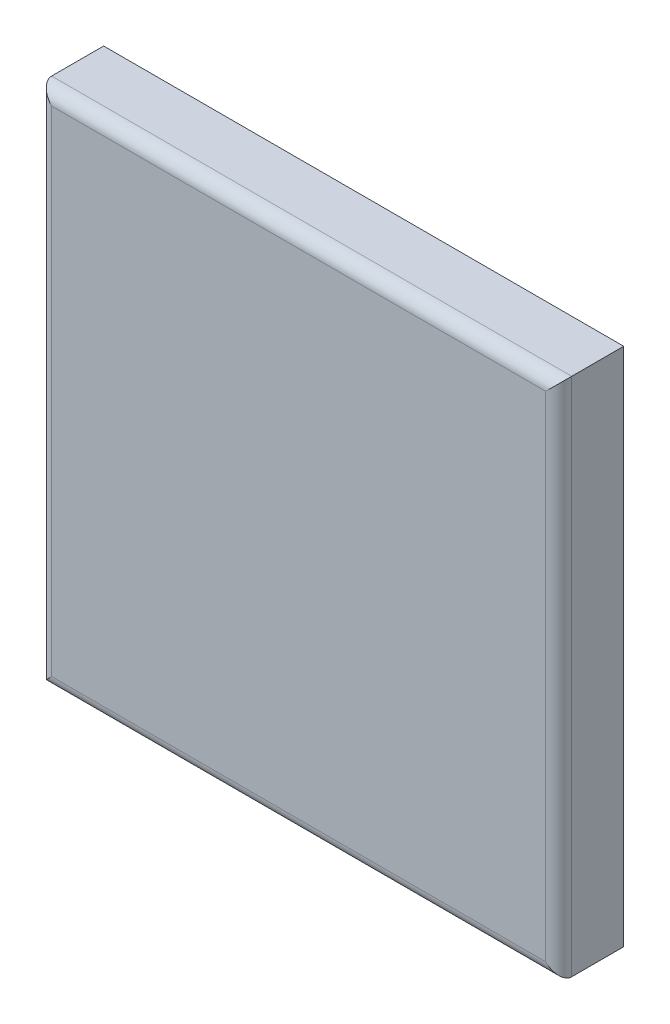
ISO-10303-21;
HEADER;
FILE_DESCRIPTION(('STEP AP214'),'2;1');
FILE_NAME('part.step','',(''),(''),'','','');
FILE_SCHEMA(('AUTOMOTIVE_DESIGN { 1 0 10303 214 1 1 1 1 }'));
ENDSEC;
DATA;
#1=APPLICATION_CONTEXT('core data for automotive mechanical design processes');
#2=APPLICATION_PROTOCOL_DEFINITION('international standard','automotive_design',2000,#1);
#3=PRODUCT_CONTEXT('',#1,'mechanical');
#4=PRODUCT('Part','Part','',(#3));
#5=PRODUCT_RELATED_PRODUCT_CATEGORY('part','',(#4));
#6=PRODUCT_DEFINITION_FORMATION('','',#4);
#7=PRODUCT_DEFINITION_CONTEXT('part definition',#1,'design');
#8=PRODUCT_DEFINITION('design','',#6,#7);
#9=PRODUCT_DEFINITION_SHAPE('','',#8);
#10=(LENGTH_UNIT() NAMED_UNIT(*) SI_UNIT(.MILLI.,.METRE.));
#11=(NAMED_UNIT(*) PLANE_ANGLE_UNIT() SI_UNIT($,.RADIAN.));
#12=(NAMED_UNIT(*) SI_UNIT($,.STERADIAN.) SOLID_ANGLE_UNIT());
#13=UNCERTAINTY_MEASURE_WITH_UNIT(LENGTH_MEASURE(1.E-05),#10,'distance_accuracy_value','');
#14=(GEOMETRIC_REPRESENTATION_CONTEXT(3) GLOBAL_UNCERTAINTY_ASSIGNED_CONTEXT((#13)) GLOBAL_UNIT_ASSIGNED_CONTEXT((#10,
#11,#12)) REPRESENTATION_CONTEXT('',''));
#15=CARTESIAN_POINT('',(0.,0.,0.));
#16=DIRECTION('',(0.,0.,1.));
#17=DIRECTION('',(1.,0.,0.));
#18=AXIS2_PLACEMENT_3D('',#15,#16,#17);
#19=CARTESIAN_POINT('',(0.5,-0.5,0.25));
#20=DIRECTION('',(-1.,0.,0.));
#21=DIRECTION('',(0.,0.,1.));
#22=AXIS2_PLACEMENT_3D('',#19,#20,#21);
#23=PLANE('',#22);
#24=DIRECTION('',(0.,0.,-1.));
#25=VECTOR('',#24,1.);
#26=CARTESIAN_POINT('',(0.5,0.5,0.25));
#27=LINE('',#26,#25);
#28=CARTESIAN_POINT('',(0.5,0.5,0.225));
#29=VERTEX_POINT('',#28);
#30=CARTESIAN_POINT('',(0.5,0.5,0.125));
#31=VERTEX_POINT('',#30);
#32=EDGE_CURVE('E11',#29,#31,#27,.T.);
#33=ORIENTED_EDGE('',*,*,#32,.F.);
#34=DIRECTION('',(0.,-1.,0.));
#35=VECTOR('',#34,1.);
#36=CARTESIAN_POINT('',(0.5,-0.5,0.225));
#37=LINE('',#36,#35);
#38=CARTESIAN_POINT('',(0.5,-0.5,0.225));
#39=VERTEX_POINT('',#38);
#40=EDGE_CURVE('E24',#29,#39,#37,.T.);
#41=ORIENTED_EDGE('',*,*,#40,.T.);
#42=DIRECTION('',(0.,0.,-1.));
#43=VECTOR('',#42,1.);
#44=CARTESIAN_POINT('',(0.5,-0.5,0.25));
#45=LINE('',#44,#43);
#46=CARTESIAN_POINT('',(0.5,-0.5,0.125));
#47=VERTEX_POINT('',#46);
#48=EDGE_CURVE('E124',#39,#47,#45,.T.);
#49=ORIENTED_EDGE('',*,*,#48,.T.);
#50=DIRECTION('',(0.,1.,0.));
#51=VECTOR('',#50,1.);
#52=CARTESIAN_POINT('',(0.5,-0.5,0.125));
#53=LINE('',#52,#51);
#54=EDGE_CURVE('E122',#47,#31,#53,.T.);
#55=ORIENTED_EDGE('',*,*,#54,.T.);
#56=EDGE_LOOP('',(#33,#41,#49,#55));
#57=FACE_BOUND('',#56,.T.);
#58=ADVANCED_FACE('F17',(#57),#23,.F.);
#59=CARTESIAN_POINT('',(-0.5,0.5,0.25));
#60=DIRECTION('',(0.,-1.,0.));
#61=DIRECTION('',(0.,0.,-1.));
#62=AXIS2_PLACEMENT_3D('',#59,#60,#61);
#63=PLANE('',#62);
#64=DIRECTION('',(0.,0.,-1.));
#65=VECTOR('',#64,1.);
#66=CARTESIAN_POINT('',(-0.5,0.5,0.25));
#67=LINE('',#66,#65);
#68=CARTESIAN_POINT('',(-0.5,0.5,0.225));
#69=VERTEX_POINT('',#68);
#70=CARTESIAN_POINT('',(-0.5,0.5,0.125));
#71=VERTEX_POINT('',#70);
#72=EDGE_CURVE('E120',#69,#71,#67,.T.);
#73=ORIENTED_EDGE('',*,*,#72,.F.);
#74=DIRECTION('',(1.,0.,0.));
#75=VECTOR('',#74,1.);
#76=CARTESIAN_POINT('',(-0.5,0.5,0.225));
#77=LINE('',#76,#75);
#78=EDGE_CURVE('E118',#69,#29,#77,.T.);
#79=ORIENTED_EDGE('',*,*,#78,.T.);
#80=ORIENTED_EDGE('',*,*,#32,.T.);
#81=DIRECTION('',(-1.,0.,0.));
#82=VECTOR('',#81,1.);
#83=CARTESIAN_POINT('',(-0.5,0.5,0.125));
#84=LINE('',#83,#82);
#85=EDGE_CURVE('E116',#31,#71,#84,.T.);
#86=ORIENTED_EDGE('',*,*,#85,.T.);
#87=EDGE_LOOP('',(#73,#79,#80,#86));
#88=FACE_BOUND('',#87,.T.);
#89=ADVANCED_FACE('F156',(#88),#63,.F.);
#90=CARTESIAN_POINT('',(-0.5,-0.5,0.25));
#91=DIRECTION('',(1.,0.,0.));
#92=DIRECTION('',(0.,0.,-1.));
#93=AXIS2_PLACEMENT_3D('',#90,#91,#92);
#94=PLANE('',#93);
#95=DIRECTION('',(0.,0.,-1.));
#96=VECTOR('',#95,1.);
#97=CARTESIAN_POINT('',(-0.5,-0.5,0.25));
#98=LINE('',#97,#96);
#99=CARTESIAN_POINT('',(-0.5,-0.5,0.225));
#100=VERTEX_POINT('',#99);
#101=CARTESIAN_POINT('',(-0.5,-0.5,0.125));
#102=VERTEX_POINT('',#101);
#103=EDGE_CURVE('E114',#100,#102,#98,.T.);
#104=ORIENTED_EDGE('',*,*,#103,.F.);
#105=DIRECTION('',(0.,1.,0.));
#106=VECTOR('',#105,1.);
#107=CARTESIAN_POINT('',(-0.5,-0.5,0.225));
#108=LINE('',#107,#106);
#109=EDGE_CURVE('E111',#100,#69,#108,.T.);
#110=ORIENTED_EDGE('',*,*,#109,.T.);
#111=ORIENTED_EDGE('',*,*,#72,.T.);
#112=DIRECTION('',(0.,-1.,0.));
#113=VECTOR('',#112,1.);
#114=CARTESIAN_POINT('',(-0.5,-0.5,0.125));
#115=LINE('',#114,#113);
#116=EDGE_CURVE('E108',#71,#102,#115,.T.);
#117=ORIENTED_EDGE('',*,*,#116,.T.);
#118=EDGE_LOOP('',(#104,#110,#111,#117));
#119=FACE_BOUND('',#118,.T.);
#120=ADVANCED_FACE('F151',(#119),#94,.F.);
#121=CARTESIAN_POINT('',(-0.5,-0.5,0.25));
#122=DIRECTION('',(0.,1.,0.));
#123=DIRECTION('',(0.,0.,1.));
#124=AXIS2_PLACEMENT_3D('',#121,#122,#123);
#125=PLANE('',#124);
#126=ORIENTED_EDGE('',*,*,#48,.F.);
#127=DIRECTION('',(-1.,0.,0.));
#128=VECTOR('',#127,1.);
#129=CARTESIAN_POINT('',(-0.5,-0.5,0.225));
#130=LINE('',#129,#128);
#131=EDGE_CURVE('E105',#39,#100,#130,.T.);
#132=ORIENTED_EDGE('',*,*,#131,.T.);
#133=ORIENTED_EDGE('',*,*,#103,.T.);
#134=DIRECTION('',(1.,0.,0.));
#135=VECTOR('',#134,1.);
#136=CARTESIAN_POINT('',(-0.5,-0.5,0.125));
#137=LINE('',#136,#135);
#138=EDGE_CURVE('E102',#102,#47,#137,.T.);
#139=ORIENTED_EDGE('',*,*,#138,.T.);
#140=EDGE_LOOP('',(#126,#132,#133,#139));
#141=FACE_BOUND('',#140,.T.);
#142=ADVANCED_FACE('F129',(#141),#125,.F.);
#143=CARTESIAN_POINT('',(0.,0.,0.25));
#144=DIRECTION('',(0.,0.,-1.));
#145=DIRECTION('',(-1.,0.,0.));
#146=AXIS2_PLACEMENT_3D('',#143,#144,#145);
#147=PLANE('',#146);
#148=DIRECTION('',(0.,-1.,0.));
#149=VECTOR('',#148,1.);
#150=CARTESIAN_POINT('',(-0.475,0.,0.25));
#151=LINE('',#150,#149);
#152=CARTESIAN_POINT('',(-0.475,0.475,0.25));
#153=VERTEX_POINT('',#152);
#154=CARTESIAN_POINT('',(-0.475,-0.475,0.25));
#155=VERTEX_POINT('',#154);
#156=EDGE_CURVE('E100',#153,#155,#151,.T.);
#157=ORIENTED_EDGE('',*,*,#156,.T.);
#158=DIRECTION('',(1.,0.,0.));
#159=VECTOR('',#158,1.);
#160=CARTESIAN_POINT('',(0.,-0.475,0.25));
#161=LINE('',#160,#159);
#162=CARTESIAN_POINT('',(0.475,-0.475,0.25));
#163=VERTEX_POINT('',#162);
#164=EDGE_CURVE('E72',#155,#163,#161,.T.);
#165=ORIENTED_EDGE('',*,*,#164,.T.);
#166=DIRECTION('',(0.,1.,0.));
#167=VECTOR('',#166,1.);
#168=CARTESIAN_POINT('',(0.475,0.,0.25));
#169=LINE('',#168,#167);
#170=CARTESIAN_POINT('',(0.475,0.475,0.25));
#171=VERTEX_POINT('',#170);
#172=EDGE_CURVE('E66',#163,#171,#169,.T.);
#173=ORIENTED_EDGE('',*,*,#172,.T.);
#174=DIRECTION('',(-1.,0.,0.));
#175=VECTOR('',#174,1.);
#176=CARTESIAN_POINT('',(0.,0.475,0.25));
#177=LINE('',#176,#175);
#178=EDGE_CURVE('E69',#171,#153,#177,.T.);
#179=ORIENTED_EDGE('',*,*,#178,.T.);
#180=EDGE_LOOP('',(#157,#165,#173,#179));
#181=FACE_BOUND('',#180,.T.);
#182=ADVANCED_FACE('F68',(#181),#147,.F.);
#183=CARTESIAN_POINT('',(0.,0.,0.125));
#184=DIRECTION('',(0.,0.,-1.));
#185=DIRECTION('',(-1.,0.,0.));
#186=AXIS2_PLACEMENT_3D('',#183,#184,#185);
#187=PLANE('',#186);
#188=ORIENTED_EDGE('',*,*,#54,.F.);
#189=ORIENTED_EDGE('',*,*,#138,.F.);
#190=ORIENTED_EDGE('',*,*,#116,.F.);
#191=ORIENTED_EDGE('',*,*,#85,.F.);
#192=EDGE_LOOP('',(#188,#189,#190,#191));
#193=FACE_BOUND('',#192,.T.);
#194=ADVANCED_FACE('F155',(#193),#187,.T.);
#195=CARTESIAN_POINT('',(0.,0.475,0.225));
#196=DIRECTION('',(-1.,0.,0.));
#197=DIRECTION('',(0.,0.,1.));
#198=AXIS2_PLACEMENT_3D('',#195,#196,#197);
#199=CYLINDRICAL_SURFACE('',#198,0.025);
#200=CARTESIAN_POINT('',(0.5,0.5,0.225));
#201=CARTESIAN_POINT('',(0.5,0.5,0.239644660940673));
#202=CARTESIAN_POINT('',(0.489644660940673,0.489644660940673,0.25));
#203=CARTESIAN_POINT('',(0.475,0.475,0.25));
#204=(BOUNDED_CURVE() B_SPLINE_CURVE(3,(#200,#201,#202,#203),.UNSPECIFIED.,.F.,
.F.) B_SPLINE_CURVE_WITH_KNOTS((4,4),(0.,1.5707963267949),
.UNSPECIFIED.) CURVE() GEOMETRIC_REPRESENTATION_ITEM() RATIONAL_B_SPLINE_CURVE((1.,
0.804737854124365,0.804737854124365,1.)) REPRESENTATION_ITEM(''));
#205=EDGE_CURVE('E82',#29,#171,#204,.T.);
#206=ORIENTED_EDGE('',*,*,#205,.F.);
#207=ORIENTED_EDGE('',*,*,#78,.F.);
#208=CARTESIAN_POINT('',(-0.475,0.475,0.25));
#209=CARTESIAN_POINT('',(-0.489644660940673,0.489644660940673,0.25));
#210=CARTESIAN_POINT('',(-0.5,0.5,0.239644660940673));
#211=CARTESIAN_POINT('',(-0.5,0.5,0.225));
#212=(BOUNDED_CURVE() B_SPLINE_CURVE(3,(#208,#209,#210,#211),.UNSPECIFIED.,.F.,
.F.) B_SPLINE_CURVE_WITH_KNOTS((4,4),(4.71238898038469,6.28318530717959),
.UNSPECIFIED.) CURVE() GEOMETRIC_REPRESENTATION_ITEM() RATIONAL_B_SPLINE_CURVE((1.,
0.804737854124365,0.804737854124365,1.)) REPRESENTATION_ITEM(''));
#213=EDGE_CURVE('E84',#153,#69,#212,.T.);
#214=ORIENTED_EDGE('',*,*,#213,.F.);
#215=ORIENTED_EDGE('',*,*,#178,.F.);
#216=EDGE_LOOP('',(#206,#207,#214,#215));
#217=FACE_BOUND('',#216,.T.);
#218=ADVANCED_FACE('F80',(#217),#199,.T.);
#219=CARTESIAN_POINT('',(-0.475,0.,0.225));
#220=DIRECTION('',(0.,-1.,0.));
#221=DIRECTION('',(0.,0.,-1.));
#222=AXIS2_PLACEMENT_3D('',#219,#220,#221);
#223=CYLINDRICAL_SURFACE('',#222,0.025);
#224=ORIENTED_EDGE('',*,*,#213,.T.);
#225=ORIENTED_EDGE('',*,*,#109,.F.);
#226=CARTESIAN_POINT('',(-0.475,-0.475,0.25));
#227=CARTESIAN_POINT('',(-0.489644660940673,-0.489644660940673,0.25));
#228=CARTESIAN_POINT('',(-0.5,-0.5,0.239644660940673));
#229=CARTESIAN_POINT('',(-0.5,-0.5,0.225));
#230=(BOUNDED_CURVE() B_SPLINE_CURVE(3,(#226,#227,#228,#229),.UNSPECIFIED.,.F.,
.F.) B_SPLINE_CURVE_WITH_KNOTS((4,4),(4.71238898038469,6.28318530717959),
.UNSPECIFIED.) CURVE() GEOMETRIC_REPRESENTATION_ITEM() RATIONAL_B_SPLINE_CURVE((1.,
0.804737854124365,0.804737854124365,1.)) REPRESENTATION_ITEM(''));
#231=EDGE_CURVE('E88',#155,#100,#230,.T.);
#232=ORIENTED_EDGE('',*,*,#231,.F.);
#233=ORIENTED_EDGE('',*,*,#156,.F.);
#234=EDGE_LOOP('',(#224,#225,#232,#233));
#235=FACE_BOUND('',#234,.T.);
#236=ADVANCED_FACE('F149',(#235),#223,.T.);
#237=CARTESIAN_POINT('',(0.475,0.,0.225));
#238=DIRECTION('',(0.,1.,0.));
#239=DIRECTION('',(0.,0.,1.));
#240=AXIS2_PLACEMENT_3D('',#237,#238,#239);
#241=CYLINDRICAL_SURFACE('',#240,0.025);
#242=ORIENTED_EDGE('',*,*,#205,.T.);
#243=ORIENTED_EDGE('',*,*,#172,.F.);
#244=CARTESIAN_POINT('',(0.5,-0.5,0.225));
#245=CARTESIAN_POINT('',(0.5,-0.5,0.239644660940673));
#246=CARTESIAN_POINT('',(0.489644660940673,-0.489644660940673,0.25));
#247=CARTESIAN_POINT('',(0.475,-0.475,0.25));
#248=(BOUNDED_CURVE() B_SPLINE_CURVE(3,(#244,#245,#246,#247),.UNSPECIFIED.,.F.,
.F.) B_SPLINE_CURVE_WITH_KNOTS((4,4),(3.14159265358979,4.71238898038469),
.UNSPECIFIED.) CURVE() GEOMETRIC_REPRESENTATION_ITEM() RATIONAL_B_SPLINE_CURVE((1.,
0.804737854124365,0.804737854124365,1.)) REPRESENTATION_ITEM(''));
#249=EDGE_CURVE('E134',#39,#163,#248,.T.);
#250=ORIENTED_EDGE('',*,*,#249,.F.);
#251=ORIENTED_EDGE('',*,*,#40,.F.);
#252=EDGE_LOOP('',(#242,#243,#250,#251));
#253=FACE_BOUND('',#252,.T.);
#254=ADVANCED_FACE('F86',(#253),#241,.T.);
#255=CARTESIAN_POINT('',(0.,-0.475,0.225));
#256=DIRECTION('',(1.,0.,0.));
#257=DIRECTION('',(0.,0.,-1.));
#258=AXIS2_PLACEMENT_3D('',#255,#256,#257);
#259=CYLINDRICAL_SURFACE('',#258,0.025);
#260=ORIENTED_EDGE('',*,*,#231,.T.);
#261=ORIENTED_EDGE('',*,*,#131,.F.);
#262=ORIENTED_EDGE('',*,*,#249,.T.);
#263=ORIENTED_EDGE('',*,*,#164,.F.);
#264=EDGE_LOOP('',(#260,#261,#262,#263));
#265=FACE_BOUND('',#264,.T.);
#266=ADVANCED_FACE('F133',(#265),#259,.T.);
#267=CLOSED_SHELL('',(#58,#89,#120,#142,#182,#194,#218,#236,#254,#266));
#268=MANIFOLD_SOLID_BREP('B1',#267);
#269=ADVANCED_BREP_SHAPE_REPRESENTATION('',(#18,#268),#14);
#270=SHAPE_DEFINITION_REPRESENTATION(#9,#269);
ENDSEC;
END-ISO-10303-21;
